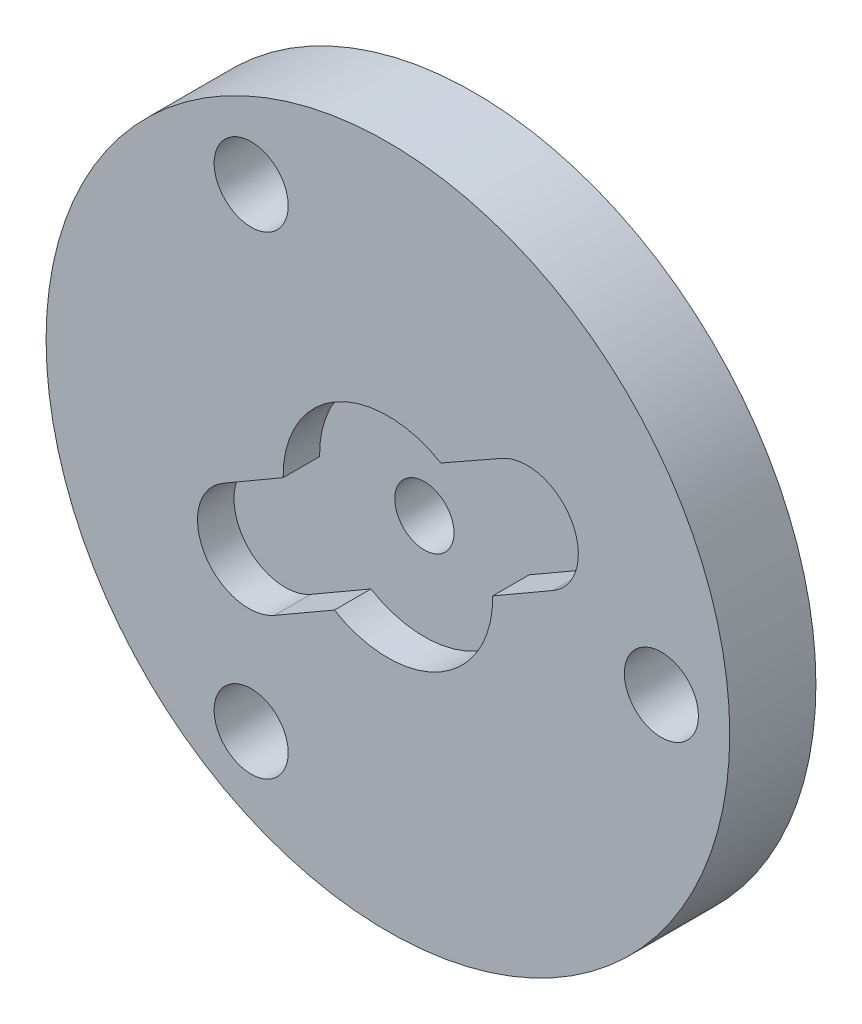
ISO-10303-21;
HEADER;
FILE_DESCRIPTION(('STEP AP214'),'2;1');
FILE_NAME('part.step','',(''),(''),'','','');
FILE_SCHEMA(('AUTOMOTIVE_DESIGN { 1 0 10303 214 1 1 1 1 }'));
ENDSEC;
DATA;
#1=APPLICATION_CONTEXT('core data for automotive mechanical design processes');
#2=APPLICATION_PROTOCOL_DEFINITION('international standard','automotive_design',2000,#1);
#3=PRODUCT_CONTEXT('',#1,'mechanical');
#4=PRODUCT('Part','Part','',(#3));
#5=PRODUCT_RELATED_PRODUCT_CATEGORY('part','',(#4));
#6=PRODUCT_DEFINITION_FORMATION('','',#4);
#7=PRODUCT_DEFINITION_CONTEXT('part definition',#1,'design');
#8=PRODUCT_DEFINITION('design','',#6,#7);
#9=PRODUCT_DEFINITION_SHAPE('','',#8);
#10=(LENGTH_UNIT() NAMED_UNIT(*) SI_UNIT(.MILLI.,.METRE.));
#11=(NAMED_UNIT(*) PLANE_ANGLE_UNIT() SI_UNIT($,.RADIAN.));
#12=(NAMED_UNIT(*) SI_UNIT($,.STERADIAN.) SOLID_ANGLE_UNIT());
#13=UNCERTAINTY_MEASURE_WITH_UNIT(LENGTH_MEASURE(1.E-05),#10,'distance_accuracy_value','');
#14=(GEOMETRIC_REPRESENTATION_CONTEXT(3) GLOBAL_UNCERTAINTY_ASSIGNED_CONTEXT((#13)) GLOBAL_UNIT_ASSIGNED_CONTEXT((#10,
#11,#12)) REPRESENTATION_CONTEXT('',''));
#15=CARTESIAN_POINT('',(0.,0.,0.));
#16=DIRECTION('',(0.,0.,1.));
#17=DIRECTION('',(1.,0.,0.));
#18=AXIS2_PLACEMENT_3D('',#15,#16,#17);
#19=CARTESIAN_POINT('',(0.,0.,0.));
#20=DIRECTION('',(0.,0.,1.));
#21=DIRECTION('',(1.,0.,0.));
#22=AXIS2_PLACEMENT_3D('',#19,#20,#21);
#23=CYLINDRICAL_SURFACE('',#22,1.3);
#24=CARTESIAN_POINT('',(0.,0.,0.));
#25=DIRECTION('',(0.,0.,1.));
#26=DIRECTION('',(1.,0.,0.));
#27=AXIS2_PLACEMENT_3D('',#24,#25,#26);
#28=CIRCLE('',#27,1.3);
#29=CARTESIAN_POINT('',(1.3,0.,0.));
#30=VERTEX_POINT('',#29);
#31=EDGE_CURVE('E166',#30,#30,#28,.T.);
#32=ORIENTED_EDGE('',*,*,#31,.F.);
#33=EDGE_LOOP('',(#32));
#34=FACE_BOUND('',#33,.T.);
#35=CARTESIAN_POINT('',(0.,0.,2.18109250195854));
#36=DIRECTION('',(0.,0.,1.));
#37=DIRECTION('',(1.,0.,0.));
#38=AXIS2_PLACEMENT_3D('',#35,#36,#37);
#39=CIRCLE('',#38,1.3);
#40=CARTESIAN_POINT('',(1.3,0.,2.18109250195854));
#41=VERTEX_POINT('',#40);
#42=EDGE_CURVE('E159',#41,#41,#39,.F.);
#43=ORIENTED_EDGE('',*,*,#42,.F.);
#44=EDGE_LOOP('',(#43));
#45=FACE_BOUND('',#44,.T.);
#46=ADVANCED_FACE('F33',(#34,#45),#23,.F.);
#47=CARTESIAN_POINT('',(0.,0.,3.78109250195854));
#48=DIRECTION('',(0.,0.,-1.));
#49=DIRECTION('',(-1.,0.,0.));
#50=AXIS2_PLACEMENT_3D('',#47,#48,#49);
#51=CYLINDRICAL_SURFACE('',#50,15.);
#52=CARTESIAN_POINT('',(0.,0.,3.78109250195854));
#53=DIRECTION('',(0.,0.,1.));
#54=DIRECTION('',(1.,0.,0.));
#55=AXIS2_PLACEMENT_3D('',#52,#53,#54);
#56=CIRCLE('',#55,15.);
#57=CARTESIAN_POINT('',(15.,0.,3.78109250195854));
#58=VERTEX_POINT('',#57);
#59=EDGE_CURVE('E11',#58,#58,#56,.T.);
#60=ORIENTED_EDGE('',*,*,#59,.F.);
#61=EDGE_LOOP('',(#60));
#62=FACE_BOUND('',#61,.T.);
#63=CARTESIAN_POINT('',(0.,0.,0.));
#64=DIRECTION('',(0.,0.,1.));
#65=DIRECTION('',(1.,0.,0.));
#66=AXIS2_PLACEMENT_3D('',#63,#64,#65);
#67=CIRCLE('',#66,15.);
#68=CARTESIAN_POINT('',(15.,0.,0.));
#69=VERTEX_POINT('',#68);
#70=EDGE_CURVE('E37',#69,#69,#67,.T.);
#71=ORIENTED_EDGE('',*,*,#70,.T.);
#72=EDGE_LOOP('',(#71));
#73=FACE_BOUND('',#72,.T.);
#74=ADVANCED_FACE('F35',(#62,#73),#51,.T.);
#75=CARTESIAN_POINT('',(0.,0.,3.78109250195854));
#76=DIRECTION('',(0.,0.,1.));
#77=DIRECTION('',(1.,0.,0.));
#78=AXIS2_PLACEMENT_3D('',#75,#76,#77);
#79=PLANE('',#78);
#80=CARTESIAN_POINT('',(0.,0.,3.78109250195854));
#81=DIRECTION('',(0.,0.,1.));
#82=DIRECTION('',(1.,0.,0.));
#83=AXIS2_PLACEMENT_3D('',#80,#81,#82);
#84=CIRCLE('',#83,4.6);
#85=CARTESIAN_POINT('',(2.32469305442951,3.96935790811149,3.78109250195854));
#86=VERTEX_POINT('',#85);
#87=CARTESIAN_POINT('',(-4.59973302824187,-0.0495587419218589,3.78109250195854));
#88=VERTEX_POINT('',#87);
#89=EDGE_CURVE('E48',#86,#88,#84,.T.);
#90=ORIENTED_EDGE('',*,*,#89,.F.);
#91=DIRECTION('',(-0.870114701846651,-0.492849272729822,0.));
#92=VECTOR('',#91,1.);
#93=CARTESIAN_POINT('',(-1.13753229242923,2.00828859092299,3.78109250195854));
#94=LINE('',#93,#92);
#95=CARTESIAN_POINT('',(4.9965682330382,5.48275807915495,3.78109250195854));
#96=VERTEX_POINT('',#95);
#97=EDGE_CURVE('E141',#96,#86,#94,.T.);
#98=ORIENTED_EDGE('',*,*,#97,.F.);
#99=CARTESIAN_POINT('',(6.1054790966803,3.52499999999999,3.78109250195854));
#100=DIRECTION('',(0.,0.,1.));
#101=DIRECTION('',(1.,0.,0.));
#102=AXIS2_PLACEMENT_3D('',#99,#100,#101);
#103=CIRCLE('',#102,2.25);
#104=CARTESIAN_POINT('',(7.23047909668027,1.57644284148498,3.78109250195854));
#105=VERTEX_POINT('',#104);
#106=EDGE_CURVE('E142',#105,#96,#103,.T.);
#107=ORIENTED_EDGE('',*,*,#106,.F.);
#108=DIRECTION('',(0.866025403784447,0.499999999999986,0.));
#109=VECTOR('',#108,1.);
#110=CARTESIAN_POINT('',(1.12499999999992,-1.94855715851492,3.78109250195854));
#111=LINE('',#110,#109);
#112=CARTESIAN_POINT('',(4.59964026915018,0.0575273362160176,3.78109250195854));
#113=VERTEX_POINT('',#112);
#114=EDGE_CURVE('E108',#113,#105,#111,.T.);
#115=ORIENTED_EDGE('',*,*,#114,.F.);
#116=CARTESIAN_POINT('',(0.,0.,3.78109250195854));
#117=DIRECTION('',(0.,0.,1.));
#118=DIRECTION('',(1.,0.,0.));
#119=AXIS2_PLACEMENT_3D('',#116,#117,#118);
#120=CIRCLE('',#119,4.6);
#121=CARTESIAN_POINT('',(-2.34964026915033,-3.95464165324586,3.78109250195854));
#122=VERTEX_POINT('',#121);
#123=EDGE_CURVE('E364',#122,#113,#120,.T.);
#124=ORIENTED_EDGE('',*,*,#123,.F.);
#125=CARTESIAN_POINT('',(-4.98047990665274,-5.47355762615256,3.78109250195854));
#126=VERTEX_POINT('',#125);
#127=EDGE_CURVE('E360',#126,#122,#111,.T.);
#128=ORIENTED_EDGE('',*,*,#127,.F.);
#129=CARTESIAN_POINT('',(-6.1054790966803,-3.52499999999999,3.78109250195854));
#130=DIRECTION('',(0.,0.,1.));
#131=DIRECTION('',(1.,0.,0.));
#132=AXIS2_PLACEMENT_3D('',#129,#130,#131);
#133=CIRCLE('',#132,2.25);
#134=CARTESIAN_POINT('',(-7.23492294659616,-1.57901526473426,3.78109250195854));
#135=VERTEX_POINT('',#134);
#136=EDGE_CURVE('E365',#135,#126,#133,.T.);
#137=ORIENTED_EDGE('',*,*,#136,.F.);
#138=DIRECTION('',(-0.864882104562547,-0.50197504440705,0.));
#139=VECTOR('',#138,1.);
#140=CARTESIAN_POINT('',(-1.13751998690618,1.95989958309481,3.78109250195854));
#141=LINE('',#140,#139);
#142=EDGE_CURVE('E370',#88,#135,#141,.T.);
#143=ORIENTED_EDGE('',*,*,#142,.F.);
#144=EDGE_LOOP('',(#90,#98,#107,#115,#124,#128,#137,#143));
#145=FACE_BOUND('',#144,.T.);
#146=CARTESIAN_POINT('',(-5.99999999999998,10.3923048454133,3.78109250195854));
#147=DIRECTION('',(0.,0.,1.));
#148=DIRECTION('',(1.,0.,0.));
#149=AXIS2_PLACEMENT_3D('',#146,#147,#148);
#150=CIRCLE('',#149,1.625);
#151=CARTESIAN_POINT('',(-4.37499999999998,10.3923048454133,3.78109250195854));
#152=VERTEX_POINT('',#151);
#153=EDGE_CURVE('E163',#152,#152,#150,.T.);
#154=ORIENTED_EDGE('',*,*,#153,.F.);
#155=EDGE_LOOP('',(#154));
#156=FACE_BOUND('',#155,.T.);
#157=CARTESIAN_POINT('',(-5.99999999999997,-10.3923048454133,3.78109250195854));
#158=DIRECTION('',(0.,0.,1.));
#159=DIRECTION('',(1.,0.,0.));
#160=AXIS2_PLACEMENT_3D('',#157,#158,#159);
#161=CIRCLE('',#160,1.625);
#162=CARTESIAN_POINT('',(-4.37499999999997,-10.3923048454133,3.78109250195854));
#163=VERTEX_POINT('',#162);
#164=EDGE_CURVE('E172',#163,#163,#161,.T.);
#165=ORIENTED_EDGE('',*,*,#164,.F.);
#166=EDGE_LOOP('',(#165));
#167=FACE_BOUND('',#166,.T.);
#168=CARTESIAN_POINT('',(12.,0.,3.78109250195854));
#169=DIRECTION('',(0.,0.,1.));
#170=DIRECTION('',(1.,0.,0.));
#171=AXIS2_PLACEMENT_3D('',#168,#169,#170);
#172=CIRCLE('',#171,1.625);
#173=CARTESIAN_POINT('',(13.625,0.,3.78109250195854));
#174=VERTEX_POINT('',#173);
#175=EDGE_CURVE('E149',#174,#174,#172,.T.);
#176=ORIENTED_EDGE('',*,*,#175,.F.);
#177=EDGE_LOOP('',(#176));
#178=FACE_BOUND('',#177,.T.);
#179=ORIENTED_EDGE('',*,*,#59,.T.);
#180=EDGE_LOOP('',(#179));
#181=FACE_BOUND('',#180,.T.);
#182=ADVANCED_FACE('F183',(#145,#156,#167,#178,#181),#79,.T.);
#183=CARTESIAN_POINT('',(0.,0.,0.));
#184=DIRECTION('',(0.,0.,1.));
#185=DIRECTION('',(1.,0.,0.));
#186=AXIS2_PLACEMENT_3D('',#183,#184,#185);
#187=PLANE('',#186);
#188=CARTESIAN_POINT('',(-5.99999999999998,10.3923048454133,0.));
#189=DIRECTION('',(0.,0.,1.));
#190=DIRECTION('',(1.,0.,0.));
#191=AXIS2_PLACEMENT_3D('',#188,#189,#190);
#192=CIRCLE('',#191,1.625);
#193=CARTESIAN_POINT('',(-4.37499999999998,10.3923048454133,0.));
#194=VERTEX_POINT('',#193);
#195=EDGE_CURVE('E160',#194,#194,#192,.T.);
#196=ORIENTED_EDGE('',*,*,#195,.T.);
#197=EDGE_LOOP('',(#196));
#198=FACE_BOUND('',#197,.T.);
#199=ORIENTED_EDGE('',*,*,#31,.T.);
#200=EDGE_LOOP('',(#199));
#201=FACE_BOUND('',#200,.T.);
#202=CARTESIAN_POINT('',(-5.99999999999997,-10.3923048454133,0.));
#203=DIRECTION('',(0.,0.,1.));
#204=DIRECTION('',(1.,0.,0.));
#205=AXIS2_PLACEMENT_3D('',#202,#203,#204);
#206=CIRCLE('',#205,1.625);
#207=CARTESIAN_POINT('',(-4.37499999999997,-10.3923048454133,0.));
#208=VERTEX_POINT('',#207);
#209=EDGE_CURVE('E169',#208,#208,#206,.T.);
#210=ORIENTED_EDGE('',*,*,#209,.T.);
#211=EDGE_LOOP('',(#210));
#212=FACE_BOUND('',#211,.T.);
#213=CARTESIAN_POINT('',(12.,0.,0.));
#214=DIRECTION('',(0.,0.,1.));
#215=DIRECTION('',(1.,0.,0.));
#216=AXIS2_PLACEMENT_3D('',#213,#214,#215);
#217=CIRCLE('',#216,1.625);
#218=CARTESIAN_POINT('',(13.625,0.,0.));
#219=VERTEX_POINT('',#218);
#220=EDGE_CURVE('E175',#219,#219,#217,.T.);
#221=ORIENTED_EDGE('',*,*,#220,.T.);
#222=EDGE_LOOP('',(#221));
#223=FACE_BOUND('',#222,.T.);
#224=ORIENTED_EDGE('',*,*,#70,.F.);
#225=EDGE_LOOP('',(#224));
#226=FACE_BOUND('',#225,.T.);
#227=ADVANCED_FACE('F186',(#198,#201,#212,#223,#226),#187,.F.);
#228=CARTESIAN_POINT('',(12.,0.,0.));
#229=DIRECTION('',(0.,0.,1.));
#230=DIRECTION('',(1.,0.,0.));
#231=AXIS2_PLACEMENT_3D('',#228,#229,#230);
#232=CYLINDRICAL_SURFACE('',#231,1.625);
#233=ORIENTED_EDGE('',*,*,#220,.F.);
#234=EDGE_LOOP('',(#233));
#235=FACE_BOUND('',#234,.T.);
#236=ORIENTED_EDGE('',*,*,#175,.T.);
#237=EDGE_LOOP('',(#236));
#238=FACE_BOUND('',#237,.T.);
#239=ADVANCED_FACE('F181',(#235,#238),#232,.F.);
#240=CARTESIAN_POINT('',(-5.99999999999997,-10.3923048454133,0.));
#241=DIRECTION('',(0.,0.,1.));
#242=DIRECTION('',(1.,0.,0.));
#243=AXIS2_PLACEMENT_3D('',#240,#241,#242);
#244=CYLINDRICAL_SURFACE('',#243,1.625);
#245=ORIENTED_EDGE('',*,*,#209,.F.);
#246=EDGE_LOOP('',(#245));
#247=FACE_BOUND('',#246,.T.);
#248=ORIENTED_EDGE('',*,*,#164,.T.);
#249=EDGE_LOOP('',(#248));
#250=FACE_BOUND('',#249,.T.);
#251=ADVANCED_FACE('F201',(#247,#250),#244,.F.);
#252=CARTESIAN_POINT('',(-5.99999999999998,10.3923048454133,0.));
#253=DIRECTION('',(0.,0.,1.));
#254=DIRECTION('',(1.,0.,0.));
#255=AXIS2_PLACEMENT_3D('',#252,#253,#254);
#256=CYLINDRICAL_SURFACE('',#255,1.625);
#257=ORIENTED_EDGE('',*,*,#195,.F.);
#258=EDGE_LOOP('',(#257));
#259=FACE_BOUND('',#258,.T.);
#260=ORIENTED_EDGE('',*,*,#153,.T.);
#261=EDGE_LOOP('',(#260));
#262=FACE_BOUND('',#261,.T.);
#263=ADVANCED_FACE('F214',(#259,#262),#256,.F.);
#264=CARTESIAN_POINT('',(0.,0.,2.18109250195854));
#265=DIRECTION('',(0.,0.,1.));
#266=DIRECTION('',(1.,0.,0.));
#267=AXIS2_PLACEMENT_3D('',#264,#265,#266);
#268=CYLINDRICAL_SURFACE('',#267,4.6);
#269=ORIENTED_EDGE('',*,*,#89,.T.);
#270=DIRECTION('',(0.,0.,1.));
#271=VECTOR('',#270,1.);
#272=CARTESIAN_POINT('',(-4.59973302824187,-0.049558741921858,2.18109250195854));
#273=LINE('',#272,#271);
#274=CARTESIAN_POINT('',(-4.59973302824187,-0.049558741921858,2.18109250195854));
#275=VERTEX_POINT('',#274);
#276=EDGE_CURVE('E84',#275,#88,#273,.T.);
#277=ORIENTED_EDGE('',*,*,#276,.F.);
#278=CARTESIAN_POINT('',(0.,0.,2.18109250195854));
#279=DIRECTION('',(0.,0.,1.));
#280=DIRECTION('',(1.,0.,0.));
#281=AXIS2_PLACEMENT_3D('',#278,#279,#280);
#282=CIRCLE('',#281,4.6);
#283=CARTESIAN_POINT('',(2.32469305442951,3.96935790811149,2.18109250195854));
#284=VERTEX_POINT('',#283);
#285=EDGE_CURVE('E138',#284,#275,#282,.T.);
#286=ORIENTED_EDGE('',*,*,#285,.F.);
#287=DIRECTION('',(0.,0.,1.));
#288=VECTOR('',#287,1.);
#289=CARTESIAN_POINT('',(2.32469305442951,3.96935790811149,2.18109250195854));
#290=LINE('',#289,#288);
#291=EDGE_CURVE('E56',#284,#86,#290,.T.);
#292=ORIENTED_EDGE('',*,*,#291,.T.);
#293=EDGE_LOOP('',(#269,#277,#286,#292));
#294=FACE_BOUND('',#293,.T.);
#295=ADVANCED_FACE('F221',(#294),#268,.F.);
#296=CARTESIAN_POINT('',(-1.13753229242923,2.00828859092299,2.18109250195854));
#297=DIRECTION('',(-0.492849272729822,0.870114701846651,0.));
#298=DIRECTION('',(-0.87011470184665,-0.492849272729822,0.));
#299=AXIS2_PLACEMENT_3D('',#296,#297,#298);
#300=PLANE('',#299);
#301=ORIENTED_EDGE('',*,*,#97,.T.);
#302=ORIENTED_EDGE('',*,*,#291,.F.);
#303=DIRECTION('',(-0.870114701846651,-0.492849272729822,0.));
#304=VECTOR('',#303,1.);
#305=CARTESIAN_POINT('',(-1.13753229242923,2.00828859092299,2.18109250195854));
#306=LINE('',#305,#304);
#307=CARTESIAN_POINT('',(4.9965682330382,5.48275807915495,2.18109250195854));
#308=VERTEX_POINT('',#307);
#309=EDGE_CURVE('E120',#308,#284,#306,.T.);
#310=ORIENTED_EDGE('',*,*,#309,.F.);
#311=DIRECTION('',(0.,0.,1.));
#312=VECTOR('',#311,1.);
#313=CARTESIAN_POINT('',(4.9965682330382,5.48275807915495,2.18109250195854));
#314=LINE('',#313,#312);
#315=EDGE_CURVE('E112',#308,#96,#314,.T.);
#316=ORIENTED_EDGE('',*,*,#315,.T.);
#317=EDGE_LOOP('',(#301,#302,#310,#316));
#318=FACE_BOUND('',#317,.T.);
#319=ADVANCED_FACE('F233',(#318),#300,.F.);
#320=CARTESIAN_POINT('',(6.1054790966803,3.52499999999999,2.18109250195854));
#321=DIRECTION('',(0.,0.,1.));
#322=DIRECTION('',(1.,0.,0.));
#323=AXIS2_PLACEMENT_3D('',#320,#321,#322);
#324=CYLINDRICAL_SURFACE('',#323,2.25);
#325=ORIENTED_EDGE('',*,*,#106,.T.);
#326=ORIENTED_EDGE('',*,*,#315,.F.);
#327=CARTESIAN_POINT('',(6.1054790966803,3.52499999999999,2.18109250195854));
#328=DIRECTION('',(0.,0.,1.));
#329=DIRECTION('',(1.,0.,0.));
#330=AXIS2_PLACEMENT_3D('',#327,#328,#329);
#331=CIRCLE('',#330,2.25);
#332=CARTESIAN_POINT('',(7.23047909668027,1.57644284148498,2.18109250195854));
#333=VERTEX_POINT('',#332);
#334=EDGE_CURVE('E116',#333,#308,#331,.T.);
#335=ORIENTED_EDGE('',*,*,#334,.F.);
#336=DIRECTION('',(0.,0.,1.));
#337=VECTOR('',#336,1.);
#338=CARTESIAN_POINT('',(7.23047909668027,1.57644284148498,2.18109250195854));
#339=LINE('',#338,#337);
#340=EDGE_CURVE('E101',#333,#105,#339,.T.);
#341=ORIENTED_EDGE('',*,*,#340,.T.);
#342=EDGE_LOOP('',(#325,#326,#335,#341));
#343=FACE_BOUND('',#342,.T.);
#344=ADVANCED_FACE('F117',(#343),#324,.F.);
#345=CARTESIAN_POINT('',(1.12499999999992,-1.94855715851492,2.18109250195854));
#346=DIRECTION('',(0.499999999999986,-0.866025403784447,0.));
#347=DIRECTION('',(0.866025403784447,0.499999999999986,0.));
#348=AXIS2_PLACEMENT_3D('',#345,#346,#347);
#349=PLANE('',#348);
#350=ORIENTED_EDGE('',*,*,#114,.T.);
#351=ORIENTED_EDGE('',*,*,#340,.F.);
#352=DIRECTION('',(0.866025403784447,0.499999999999986,0.));
#353=VECTOR('',#352,1.);
#354=CARTESIAN_POINT('',(1.12499999999992,-1.94855715851492,2.18109250195854));
#355=LINE('',#354,#353);
#356=CARTESIAN_POINT('',(4.59964026915018,0.0575273362160176,2.18109250195854));
#357=VERTEX_POINT('',#356);
#358=EDGE_CURVE('E105',#357,#333,#355,.T.);
#359=ORIENTED_EDGE('',*,*,#358,.F.);
#360=DIRECTION('',(0.,0.,1.));
#361=VECTOR('',#360,1.);
#362=CARTESIAN_POINT('',(4.59964026915018,0.0575273362160176,2.18109250195854));
#363=LINE('',#362,#361);
#364=EDGE_CURVE('E113',#357,#113,#363,.T.);
#365=ORIENTED_EDGE('',*,*,#364,.T.);
#366=EDGE_LOOP('',(#350,#351,#359,#365));
#367=FACE_BOUND('',#366,.T.);
#368=ADVANCED_FACE('F103',(#367),#349,.F.);
#369=CARTESIAN_POINT('',(0.,0.,2.18109250195854));
#370=DIRECTION('',(0.,0.,1.));
#371=DIRECTION('',(1.,0.,0.));
#372=AXIS2_PLACEMENT_3D('',#369,#370,#371);
#373=CYLINDRICAL_SURFACE('',#372,4.6);
#374=ORIENTED_EDGE('',*,*,#123,.T.);
#375=ORIENTED_EDGE('',*,*,#364,.F.);
#376=CARTESIAN_POINT('',(0.,0.,2.18109250195854));
#377=DIRECTION('',(0.,0.,1.));
#378=DIRECTION('',(1.,0.,0.));
#379=AXIS2_PLACEMENT_3D('',#376,#377,#378);
#380=CIRCLE('',#379,4.6);
#381=CARTESIAN_POINT('',(-2.34964026915033,-3.95464165324586,2.18109250195854));
#382=VERTEX_POINT('',#381);
#383=EDGE_CURVE('E127',#382,#357,#380,.T.);
#384=ORIENTED_EDGE('',*,*,#383,.F.);
#385=DIRECTION('',(0.,0.,1.));
#386=VECTOR('',#385,1.);
#387=CARTESIAN_POINT('',(-2.34964026915033,-3.95464165324586,2.18109250195854));
#388=LINE('',#387,#386);
#389=EDGE_CURVE('E152',#382,#122,#388,.T.);
#390=ORIENTED_EDGE('',*,*,#389,.T.);
#391=EDGE_LOOP('',(#374,#375,#384,#390));
#392=FACE_BOUND('',#391,.T.);
#393=ADVANCED_FACE('F252',(#392),#373,.F.);
#394=ORIENTED_EDGE('',*,*,#127,.T.);
#395=ORIENTED_EDGE('',*,*,#389,.F.);
#396=CARTESIAN_POINT('',(-4.98047990665274,-5.47355762615256,2.18109250195854));
#397=VERTEX_POINT('',#396);
#398=EDGE_CURVE('E129',#397,#382,#355,.T.);
#399=ORIENTED_EDGE('',*,*,#398,.F.);
#400=DIRECTION('',(0.,0.,1.));
#401=VECTOR('',#400,1.);
#402=CARTESIAN_POINT('',(-4.98047990665274,-5.47355762615256,2.18109250195854));
#403=LINE('',#402,#401);
#404=EDGE_CURVE('E154',#397,#126,#403,.T.);
#405=ORIENTED_EDGE('',*,*,#404,.T.);
#406=EDGE_LOOP('',(#394,#395,#399,#405));
#407=FACE_BOUND('',#406,.T.);
#408=ADVANCED_FACE('F250',(#407),#349,.F.);
#409=CARTESIAN_POINT('',(-6.1054790966803,-3.52499999999999,2.18109250195854));
#410=DIRECTION('',(0.,0.,1.));
#411=DIRECTION('',(1.,0.,0.));
#412=AXIS2_PLACEMENT_3D('',#409,#410,#411);
#413=CYLINDRICAL_SURFACE('',#412,2.25);
#414=ORIENTED_EDGE('',*,*,#136,.T.);
#415=ORIENTED_EDGE('',*,*,#404,.F.);
#416=CARTESIAN_POINT('',(-6.1054790966803,-3.52499999999999,2.18109250195854));
#417=DIRECTION('',(0.,0.,1.));
#418=DIRECTION('',(1.,0.,0.));
#419=AXIS2_PLACEMENT_3D('',#416,#417,#418);
#420=CIRCLE('',#419,2.25);
#421=CARTESIAN_POINT('',(-7.23492294659616,-1.57901526473426,2.18109250195854));
#422=VERTEX_POINT('',#421);
#423=EDGE_CURVE('E132',#422,#397,#420,.T.);
#424=ORIENTED_EDGE('',*,*,#423,.F.);
#425=DIRECTION('',(0.,0.,1.));
#426=VECTOR('',#425,1.);
#427=CARTESIAN_POINT('',(-7.23492294659616,-1.57901526473426,2.18109250195854));
#428=LINE('',#427,#426);
#429=EDGE_CURVE('E156',#422,#135,#428,.T.);
#430=ORIENTED_EDGE('',*,*,#429,.T.);
#431=EDGE_LOOP('',(#414,#415,#424,#430));
#432=FACE_BOUND('',#431,.T.);
#433=ADVANCED_FACE('F246',(#432),#413,.F.);
#434=CARTESIAN_POINT('',(-1.13751998690618,1.95989958309481,2.18109250195854));
#435=DIRECTION('',(-0.501975044407049,0.864882104562547,0.));
#436=DIRECTION('',(-0.864882104562547,-0.501975044407049,0.));
#437=AXIS2_PLACEMENT_3D('',#434,#435,#436);
#438=PLANE('',#437);
#439=ORIENTED_EDGE('',*,*,#142,.T.);
#440=ORIENTED_EDGE('',*,*,#429,.F.);
#441=DIRECTION('',(-0.864882104562547,-0.50197504440705,0.));
#442=VECTOR('',#441,1.);
#443=CARTESIAN_POINT('',(-1.13751998690618,1.95989958309481,2.18109250195854));
#444=LINE('',#443,#442);
#445=EDGE_CURVE('E135',#275,#422,#444,.T.);
#446=ORIENTED_EDGE('',*,*,#445,.F.);
#447=ORIENTED_EDGE('',*,*,#276,.T.);
#448=EDGE_LOOP('',(#439,#440,#446,#447));
#449=FACE_BOUND('',#448,.T.);
#450=ADVANCED_FACE('F243',(#449),#438,.F.);
#451=CARTESIAN_POINT('',(0.,0.,2.18109250195854));
#452=DIRECTION('',(0.,0.,1.));
#453=DIRECTION('',(1.,0.,0.));
#454=AXIS2_PLACEMENT_3D('',#451,#452,#453);
#455=PLANE('',#454);
#456=ORIENTED_EDGE('',*,*,#285,.T.);
#457=ORIENTED_EDGE('',*,*,#445,.T.);
#458=ORIENTED_EDGE('',*,*,#423,.T.);
#459=ORIENTED_EDGE('',*,*,#398,.T.);
#460=ORIENTED_EDGE('',*,*,#383,.T.);
#461=ORIENTED_EDGE('',*,*,#358,.T.);
#462=ORIENTED_EDGE('',*,*,#334,.T.);
#463=ORIENTED_EDGE('',*,*,#309,.T.);
#464=EDGE_LOOP('',(#456,#457,#458,#459,#460,#461,#462,#463));
#465=FACE_BOUND('',#464,.T.);
#466=ORIENTED_EDGE('',*,*,#42,.T.);
#467=EDGE_LOOP('',(#466));
#468=FACE_BOUND('',#467,.T.);
#469=ADVANCED_FACE('F123',(#465,#468),#455,.T.);
#470=CLOSED_SHELL('',(#46,#74,#182,#227,#239,#251,#263,#295,#319,#344,#368,#393,#408,#433,#450,#469));
#471=MANIFOLD_SOLID_BREP('B2',#470);
#472=ADVANCED_BREP_SHAPE_REPRESENTATION('',(#18,#471),#14);
#473=SHAPE_DEFINITION_REPRESENTATION(#9,#472);
ENDSEC;
END-ISO-10303-21;
